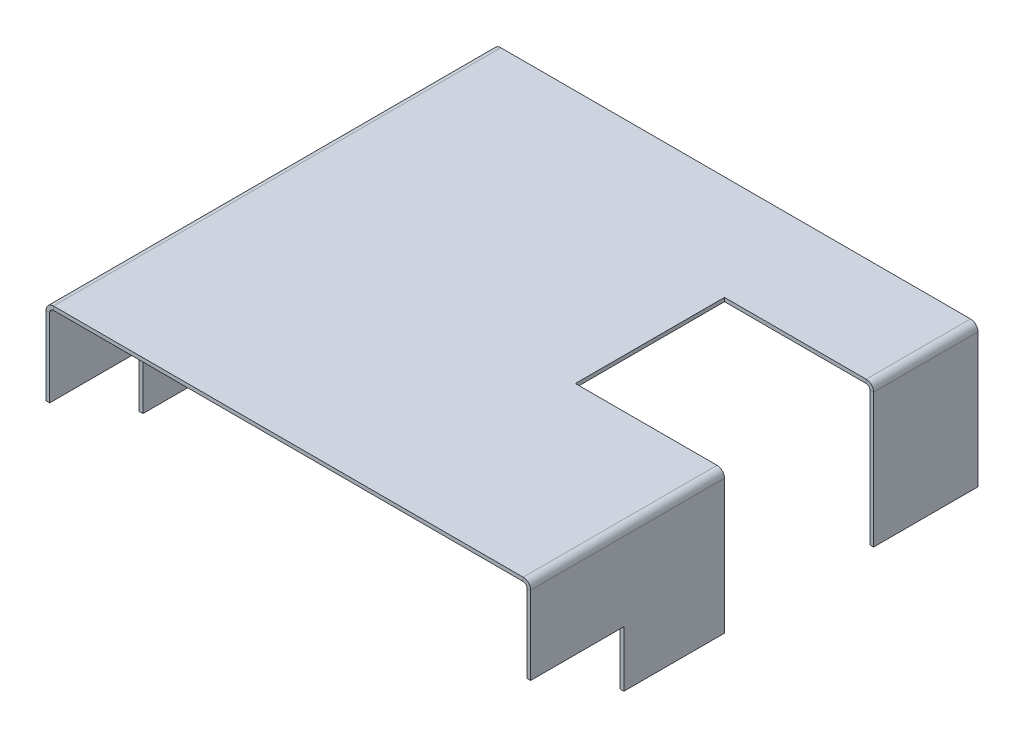
ISO-10303-21;
HEADER;
FILE_DESCRIPTION(('STEP AP214'),'2;1');
FILE_NAME('part.step','',(''),(''),'','','');
FILE_SCHEMA(('AUTOMOTIVE_DESIGN { 1 0 10303 214 1 1 1 1 }'));
ENDSEC;
DATA;
#1=APPLICATION_CONTEXT('core data for automotive mechanical design processes');
#2=APPLICATION_PROTOCOL_DEFINITION('international standard','automotive_design',2000,#1);
#3=PRODUCT_CONTEXT('',#1,'mechanical');
#4=PRODUCT('Part','Part','',(#3));
#5=PRODUCT_RELATED_PRODUCT_CATEGORY('part','',(#4));
#6=PRODUCT_DEFINITION_FORMATION('','',#4);
#7=PRODUCT_DEFINITION_CONTEXT('part definition',#1,'design');
#8=PRODUCT_DEFINITION('design','',#6,#7);
#9=PRODUCT_DEFINITION_SHAPE('','',#8);
#10=(LENGTH_UNIT() NAMED_UNIT(*) SI_UNIT(.MILLI.,.METRE.));
#11=(NAMED_UNIT(*) PLANE_ANGLE_UNIT() SI_UNIT($,.RADIAN.));
#12=(NAMED_UNIT(*) SI_UNIT($,.STERADIAN.) SOLID_ANGLE_UNIT());
#13=UNCERTAINTY_MEASURE_WITH_UNIT(LENGTH_MEASURE(1.E-05),#10,'distance_accuracy_value','');
#14=(GEOMETRIC_REPRESENTATION_CONTEXT(3) GLOBAL_UNCERTAINTY_ASSIGNED_CONTEXT((#13)) GLOBAL_UNIT_ASSIGNED_CONTEXT((#10,
#11,#12)) REPRESENTATION_CONTEXT('',''));
#15=CARTESIAN_POINT('',(0.,0.,0.));
#16=DIRECTION('',(0.,0.,1.));
#17=DIRECTION('',(1.,0.,0.));
#18=AXIS2_PLACEMENT_3D('',#15,#16,#17);
#19=CARTESIAN_POINT('',(31.75,0.,-66.04));
#20=DIRECTION('',(0.,0.,1.));
#21=DIRECTION('',(1.,0.,0.));
#22=AXIS2_PLACEMENT_3D('',#19,#20,#21);
#23=PLANE('',#22);
#24=DIRECTION('',(1.,0.,0.));
#25=VECTOR('',#24,1.);
#26=CARTESIAN_POINT('',(31.75,48.26,-66.04));
#27=LINE('',#26,#25);
#28=CARTESIAN_POINT('',(31.75,48.26,-66.04));
#29=VERTEX_POINT('',#28);
#30=CARTESIAN_POINT('',(80.0099999999999,48.26,-66.04));
#31=VERTEX_POINT('',#30);
#32=EDGE_CURVE('E202',#29,#31,#27,.T.);
#33=ORIENTED_EDGE('',*,*,#32,.T.);
#34=DIRECTION('',(0.,-1.,0.));
#35=VECTOR('',#34,1.);
#36=CARTESIAN_POINT('',(80.0099999999999,48.26,-66.04));
#37=LINE('',#36,#35);
#38=CARTESIAN_POINT('',(80.01,46.99,-66.04));
#39=VERTEX_POINT('',#38);
#40=EDGE_CURVE('E11',#31,#39,#37,.T.);
#41=ORIENTED_EDGE('',*,*,#40,.T.);
#42=DIRECTION('',(-1.,0.,0.));
#43=VECTOR('',#42,1.);
#44=CARTESIAN_POINT('',(-81.28,46.99,-66.04));
#45=LINE('',#44,#43);
#46=CARTESIAN_POINT('',(31.75,46.99,-66.04));
#47=VERTEX_POINT('',#46);
#48=EDGE_CURVE('E205',#39,#47,#45,.T.);
#49=ORIENTED_EDGE('',*,*,#48,.T.);
#50=DIRECTION('',(0.,1.,0.));
#51=VECTOR('',#50,1.);
#52=CARTESIAN_POINT('',(31.75,0.,-66.04));
#53=LINE('',#52,#51);
#54=EDGE_CURVE('E199',#47,#29,#53,.T.);
#55=ORIENTED_EDGE('',*,*,#54,.T.);
#56=EDGE_LOOP('',(#33,#41,#49,#55));
#57=FACE_BOUND('',#56,.T.);
#58=ADVANCED_FACE('F38',(#57),#23,.F.);
#59=DIRECTION('',(0.,1.,0.));
#60=VECTOR('',#59,1.);
#61=CARTESIAN_POINT('',(81.28,46.99,-66.04));
#62=LINE('',#61,#60);
#63=CARTESIAN_POINT('',(81.28,0.,-66.04));
#64=VERTEX_POINT('',#63);
#65=CARTESIAN_POINT('',(81.28,45.72,-66.04));
#66=VERTEX_POINT('',#65);
#67=EDGE_CURVE('E237',#64,#66,#62,.T.);
#68=ORIENTED_EDGE('',*,*,#67,.T.);
#69=DIRECTION('',(1.,0.,0.));
#70=VECTOR('',#69,1.);
#71=CARTESIAN_POINT('',(81.28,45.72,-66.04));
#72=LINE('',#71,#70);
#73=CARTESIAN_POINT('',(82.55,45.72,-66.04));
#74=VERTEX_POINT('',#73);
#75=EDGE_CURVE('E46',#66,#74,#72,.T.);
#76=ORIENTED_EDGE('',*,*,#75,.T.);
#77=DIRECTION('',(0.,1.,0.));
#78=VECTOR('',#77,1.);
#79=CARTESIAN_POINT('',(82.55,46.99,-66.04));
#80=LINE('',#79,#78);
#81=CARTESIAN_POINT('',(82.55,0.,-66.04));
#82=VERTEX_POINT('',#81);
#83=EDGE_CURVE('E229',#82,#74,#80,.T.);
#84=ORIENTED_EDGE('',*,*,#83,.F.);
#85=DIRECTION('',(1.,0.,0.));
#86=VECTOR('',#85,1.);
#87=CARTESIAN_POINT('',(31.75,0.,-66.04));
#88=LINE('',#87,#86);
#89=EDGE_CURVE('E225',#64,#82,#88,.T.);
#90=ORIENTED_EDGE('',*,*,#89,.F.);
#91=EDGE_LOOP('',(#68,#76,#84,#90));
#92=FACE_BOUND('',#91,.T.);
#93=ADVANCED_FACE('F412',(#92),#23,.F.);
#94=CARTESIAN_POINT('',(31.75,0.,-116.84));
#95=DIRECTION('',(0.,0.,-1.));
#96=DIRECTION('',(-1.,0.,0.));
#97=AXIS2_PLACEMENT_3D('',#94,#95,#96);
#98=PLANE('',#97);
#99=DIRECTION('',(1.,0.,0.));
#100=VECTOR('',#99,1.);
#101=CARTESIAN_POINT('',(-81.28,46.99,-116.84));
#102=LINE('',#101,#100);
#103=CARTESIAN_POINT('',(31.75,46.99,-116.84));
#104=VERTEX_POINT('',#103);
#105=CARTESIAN_POINT('',(80.01,46.99,-116.84));
#106=VERTEX_POINT('',#105);
#107=EDGE_CURVE('E246',#104,#106,#102,.T.);
#108=ORIENTED_EDGE('',*,*,#107,.T.);
#109=DIRECTION('',(0.,1.,0.));
#110=VECTOR('',#109,1.);
#111=CARTESIAN_POINT('',(80.01,46.99,-116.84));
#112=LINE('',#111,#110);
#113=CARTESIAN_POINT('',(80.01,48.26,-116.84));
#114=VERTEX_POINT('',#113);
#115=EDGE_CURVE('E410',#106,#114,#112,.T.);
#116=ORIENTED_EDGE('',*,*,#115,.T.);
#117=DIRECTION('',(-1.,0.,0.));
#118=VECTOR('',#117,1.);
#119=CARTESIAN_POINT('',(31.75,48.26,-116.84));
#120=LINE('',#119,#118);
#121=CARTESIAN_POINT('',(31.75,48.26,-116.84));
#122=VERTEX_POINT('',#121);
#123=EDGE_CURVE('E223',#114,#122,#120,.T.);
#124=ORIENTED_EDGE('',*,*,#123,.T.);
#125=DIRECTION('',(0.,1.,0.));
#126=VECTOR('',#125,1.);
#127=CARTESIAN_POINT('',(31.75,0.,-116.84));
#128=LINE('',#127,#126);
#129=EDGE_CURVE('E208',#104,#122,#128,.T.);
#130=ORIENTED_EDGE('',*,*,#129,.F.);
#131=EDGE_LOOP('',(#108,#116,#124,#130));
#132=FACE_BOUND('',#131,.T.);
#133=ADVANCED_FACE('F472',(#132),#98,.F.);
#134=DIRECTION('',(0.,-1.,0.));
#135=VECTOR('',#134,1.);
#136=CARTESIAN_POINT('',(82.55,46.99,-116.84));
#137=LINE('',#136,#135);
#138=CARTESIAN_POINT('',(82.55,45.72,-116.84));
#139=VERTEX_POINT('',#138);
#140=CARTESIAN_POINT('',(82.55,0.,-116.84));
#141=VERTEX_POINT('',#140);
#142=EDGE_CURVE('E240',#139,#141,#137,.T.);
#143=ORIENTED_EDGE('',*,*,#142,.F.);
#144=DIRECTION('',(-1.,0.,0.));
#145=VECTOR('',#144,1.);
#146=CARTESIAN_POINT('',(82.55,45.72,-116.84));
#147=LINE('',#146,#145);
#148=CARTESIAN_POINT('',(81.28,45.72,-116.84));
#149=VERTEX_POINT('',#148);
#150=EDGE_CURVE('E408',#139,#149,#147,.T.);
#151=ORIENTED_EDGE('',*,*,#150,.T.);
#152=DIRECTION('',(0.,-1.,0.));
#153=VECTOR('',#152,1.);
#154=CARTESIAN_POINT('',(81.28,46.99,-116.84));
#155=LINE('',#154,#153);
#156=CARTESIAN_POINT('',(81.28,0.,-116.84));
#157=VERTEX_POINT('',#156);
#158=EDGE_CURVE('E249',#149,#157,#155,.T.);
#159=ORIENTED_EDGE('',*,*,#158,.T.);
#160=DIRECTION('',(-1.,0.,0.));
#161=VECTOR('',#160,1.);
#162=CARTESIAN_POINT('',(31.75,0.,-116.84));
#163=LINE('',#162,#161);
#164=EDGE_CURVE('E209',#141,#157,#163,.T.);
#165=ORIENTED_EDGE('',*,*,#164,.F.);
#166=EDGE_LOOP('',(#143,#151,#159,#165));
#167=FACE_BOUND('',#166,.T.);
#168=ADVANCED_FACE('F462',(#167),#98,.F.);
#169=CARTESIAN_POINT('',(81.28,0.,-152.4));
#170=DIRECTION('',(0.,-1.,0.));
#171=DIRECTION('',(0.,0.,1.));
#172=AXIS2_PLACEMENT_3D('',#169,#170,#171);
#173=PLANE('',#172);
#174=ORIENTED_EDGE('',*,*,#164,.T.);
#175=DIRECTION('',(0.,0.,1.));
#176=VECTOR('',#175,1.);
#177=CARTESIAN_POINT('',(81.28,0.,-152.4));
#178=LINE('',#177,#176);
#179=CARTESIAN_POINT('',(81.28,0.,-152.4));
#180=VERTEX_POINT('',#179);
#181=EDGE_CURVE('E302',#180,#157,#178,.T.);
#182=ORIENTED_EDGE('',*,*,#181,.F.);
#183=DIRECTION('',(-1.,0.,0.));
#184=VECTOR('',#183,1.);
#185=CARTESIAN_POINT('',(81.28,0.,-152.4));
#186=LINE('',#185,#184);
#187=CARTESIAN_POINT('',(82.55,0.,-152.4));
#188=VERTEX_POINT('',#187);
#189=EDGE_CURVE('E378',#188,#180,#186,.T.);
#190=ORIENTED_EDGE('',*,*,#189,.F.);
#191=DIRECTION('',(0.,0.,1.));
#192=VECTOR('',#191,1.);
#193=CARTESIAN_POINT('',(82.55,0.,-152.4));
#194=LINE('',#193,#192);
#195=EDGE_CURVE('E349',#188,#141,#194,.T.);
#196=ORIENTED_EDGE('',*,*,#195,.T.);
#197=EDGE_LOOP('',(#174,#182,#190,#196));
#198=FACE_BOUND('',#197,.T.);
#199=ADVANCED_FACE('F445',(#198),#173,.T.);
#200=CARTESIAN_POINT('',(81.28,46.99,-152.4));
#201=DIRECTION('',(-1.,0.,0.));
#202=DIRECTION('',(0.,-1.,0.));
#203=AXIS2_PLACEMENT_3D('',#200,#201,#202);
#204=PLANE('',#203);
#205=ORIENTED_EDGE('',*,*,#158,.F.);
#206=DIRECTION('',(0.,0.,1.));
#207=VECTOR('',#206,1.);
#208=CARTESIAN_POINT('',(81.28,45.72,-152.4));
#209=LINE('',#208,#207);
#210=CARTESIAN_POINT('',(81.28,45.72,-152.4));
#211=VERTEX_POINT('',#210);
#212=EDGE_CURVE('E309',#149,#211,#209,.F.);
#213=ORIENTED_EDGE('',*,*,#212,.T.);
#214=DIRECTION('',(0.,-1.,0.));
#215=VECTOR('',#214,1.);
#216=CARTESIAN_POINT('',(81.28,46.99,-152.4));
#217=LINE('',#216,#215);
#218=EDGE_CURVE('E298',#211,#180,#217,.T.);
#219=ORIENTED_EDGE('',*,*,#218,.T.);
#220=ORIENTED_EDGE('',*,*,#181,.T.);
#221=EDGE_LOOP('',(#205,#213,#219,#220));
#222=FACE_BOUND('',#221,.T.);
#223=ADVANCED_FACE('F451',(#222),#204,.T.);
#224=CARTESIAN_POINT('',(80.01,45.72,-152.4));
#225=DIRECTION('',(0.,0.,-1.));
#226=DIRECTION('',(-1.,0.,0.));
#227=AXIS2_PLACEMENT_3D('',#224,#225,#226);
#228=CYLINDRICAL_SURFACE('',#227,1.27);
#229=ORIENTED_EDGE('',*,*,#212,.F.);
#230=CARTESIAN_POINT('',(80.01,45.72,-116.84));
#231=DIRECTION('',(0.,0.,-1.));
#232=DIRECTION('',(-1.,0.,0.));
#233=AXIS2_PLACEMENT_3D('',#230,#231,#232);
#234=CIRCLE('',#233,1.27);
#235=EDGE_CURVE('E243',#149,#106,#234,.F.);
#236=ORIENTED_EDGE('',*,*,#235,.T.);
#237=DIRECTION('',(0.,0.,1.));
#238=VECTOR('',#237,1.);
#239=CARTESIAN_POINT('',(80.01,46.99,0.));
#240=LINE('',#239,#238);
#241=CARTESIAN_POINT('',(80.01,46.99,-152.4));
#242=VERTEX_POINT('',#241);
#243=EDGE_CURVE('E306',#242,#106,#240,.T.);
#244=ORIENTED_EDGE('',*,*,#243,.F.);
#245=CARTESIAN_POINT('',(80.01,45.72,-152.4));
#246=DIRECTION('',(0.,0.,1.));
#247=DIRECTION('',(1.,0.,0.));
#248=AXIS2_PLACEMENT_3D('',#245,#246,#247);
#249=CIRCLE('',#248,1.27);
#250=EDGE_CURVE('E283',#242,#211,#249,.F.);
#251=ORIENTED_EDGE('',*,*,#250,.T.);
#252=EDGE_LOOP('',(#229,#236,#244,#251));
#253=FACE_BOUND('',#252,.T.);
#254=ADVANCED_FACE('F477',(#253),#228,.F.);
#255=CARTESIAN_POINT('',(82.55,46.99,-152.4));
#256=DIRECTION('',(-1.,0.,0.));
#257=DIRECTION('',(0.,-1.,0.));
#258=AXIS2_PLACEMENT_3D('',#255,#256,#257);
#259=PLANE('',#258);
#260=DIRECTION('',(0.,0.,1.));
#261=VECTOR('',#260,1.);
#262=CARTESIAN_POINT('',(82.55,45.72,-152.4));
#263=LINE('',#262,#261);
#264=CARTESIAN_POINT('',(82.55,45.72,-152.4));
#265=VERTEX_POINT('',#264);
#266=EDGE_CURVE('E336',#139,#265,#263,.F.);
#267=ORIENTED_EDGE('',*,*,#266,.F.);
#268=ORIENTED_EDGE('',*,*,#142,.T.);
#269=ORIENTED_EDGE('',*,*,#195,.F.);
#270=DIRECTION('',(0.,-1.,0.));
#271=VECTOR('',#270,1.);
#272=CARTESIAN_POINT('',(82.55,46.99,-152.4));
#273=LINE('',#272,#271);
#274=EDGE_CURVE('E347',#265,#188,#273,.T.);
#275=ORIENTED_EDGE('',*,*,#274,.F.);
#276=EDGE_LOOP('',(#267,#268,#269,#275));
#277=FACE_BOUND('',#276,.T.);
#278=ADVANCED_FACE('F460',(#277),#259,.F.);
#279=CARTESIAN_POINT('',(80.01,45.72,-152.4));
#280=DIRECTION('',(0.,0.,-1.));
#281=DIRECTION('',(-1.,0.,0.));
#282=AXIS2_PLACEMENT_3D('',#279,#280,#281);
#283=CYLINDRICAL_SURFACE('',#282,2.54);
#284=CARTESIAN_POINT('',(80.01,45.72,-116.84));
#285=DIRECTION('',(0.,0.,-1.));
#286=DIRECTION('',(-1.,0.,0.));
#287=AXIS2_PLACEMENT_3D('',#284,#285,#286);
#288=CIRCLE('',#287,2.54);
#289=EDGE_CURVE('E405',#139,#114,#288,.F.);
#290=ORIENTED_EDGE('',*,*,#289,.F.);
#291=ORIENTED_EDGE('',*,*,#266,.T.);
#292=CARTESIAN_POINT('',(80.01,45.72,-152.4));
#293=DIRECTION('',(0.,0.,-1.));
#294=DIRECTION('',(-1.,0.,0.));
#295=AXIS2_PLACEMENT_3D('',#292,#293,#294);
#296=CIRCLE('',#295,2.54);
#297=CARTESIAN_POINT('',(80.0099999999999,48.26,-152.4));
#298=VERTEX_POINT('',#297);
#299=EDGE_CURVE('E355',#298,#265,#296,.T.);
#300=ORIENTED_EDGE('',*,*,#299,.F.);
#301=DIRECTION('',(0.,0.,-1.));
#302=VECTOR('',#301,1.);
#303=CARTESIAN_POINT('',(80.0099999999999,48.26,-152.4));
#304=LINE('',#303,#302);
#305=EDGE_CURVE('E337',#298,#114,#304,.F.);
#306=ORIENTED_EDGE('',*,*,#305,.T.);
#307=EDGE_LOOP('',(#290,#291,#300,#306));
#308=FACE_BOUND('',#307,.T.);
#309=ADVANCED_FACE('F465',(#308),#283,.T.);
#310=CARTESIAN_POINT('',(-81.28,46.99,0.));
#311=DIRECTION('',(0.,0.,-1.));
#312=DIRECTION('',(1.,0.,0.));
#313=AXIS2_PLACEMENT_3D('',#310,#311,#312);
#314=PLANE('',#313);
#315=DIRECTION('',(0.,-1.,0.));
#316=VECTOR('',#315,1.);
#317=CARTESIAN_POINT('',(80.01,46.99,0.));
#318=LINE('',#317,#316);
#319=CARTESIAN_POINT('',(80.01,48.26,0.));
#320=VERTEX_POINT('',#319);
#321=CARTESIAN_POINT('',(80.01,46.99,0.));
#322=VERTEX_POINT('',#321);
#323=EDGE_CURVE('E396',#320,#322,#318,.T.);
#324=ORIENTED_EDGE('',*,*,#323,.F.);
#325=DIRECTION('',(1.,0.,0.));
#326=VECTOR('',#325,1.);
#327=CARTESIAN_POINT('',(-81.28,48.26,0.));
#328=LINE('',#327,#326);
#329=CARTESIAN_POINT('',(-80.01,48.26,0.));
#330=VERTEX_POINT('',#329);
#331=EDGE_CURVE('E362',#330,#320,#328,.T.);
#332=ORIENTED_EDGE('',*,*,#331,.F.);
#333=DIRECTION('',(0.,-1.,0.));
#334=VECTOR('',#333,1.);
#335=CARTESIAN_POINT('',(-80.01,46.99,0.));
#336=LINE('',#335,#334);
#337=CARTESIAN_POINT('',(-80.01,46.99,0.));
#338=VERTEX_POINT('',#337);
#339=EDGE_CURVE('E394',#330,#338,#336,.T.);
#340=ORIENTED_EDGE('',*,*,#339,.T.);
#341=DIRECTION('',(1.,0.,0.));
#342=VECTOR('',#341,1.);
#343=CARTESIAN_POINT('',(-81.28,46.99,0.));
#344=LINE('',#343,#342);
#345=EDGE_CURVE('E289',#338,#322,#344,.T.);
#346=ORIENTED_EDGE('',*,*,#345,.T.);
#347=EDGE_LOOP('',(#324,#332,#340,#346));
#348=FACE_BOUND('',#347,.T.);
#349=ADVANCED_FACE('F594',(#348),#314,.F.);
#350=CARTESIAN_POINT('',(-80.01,45.72,0.));
#351=DIRECTION('',(0.,0.,1.));
#352=DIRECTION('',(1.,0.,0.));
#353=AXIS2_PLACEMENT_3D('',#350,#351,#352);
#354=PLANE('',#353);
#355=ORIENTED_EDGE('',*,*,#339,.F.);
#356=CARTESIAN_POINT('',(-80.01,45.72,0.));
#357=DIRECTION('',(0.,0.,-1.));
#358=DIRECTION('',(-1.,0.,0.));
#359=AXIS2_PLACEMENT_3D('',#356,#357,#358);
#360=CIRCLE('',#359,2.54);
#361=CARTESIAN_POINT('',(-82.55,45.72,0.));
#362=VERTEX_POINT('',#361);
#363=EDGE_CURVE('E279',#330,#362,#360,.F.);
#364=ORIENTED_EDGE('',*,*,#363,.T.);
#365=DIRECTION('',(1.,0.,0.));
#366=VECTOR('',#365,1.);
#367=CARTESIAN_POINT('',(-81.28,45.72,0.));
#368=LINE('',#367,#366);
#369=CARTESIAN_POINT('',(-81.28,45.72,0.));
#370=VERTEX_POINT('',#369);
#371=EDGE_CURVE('E391',#362,#370,#368,.T.);
#372=ORIENTED_EDGE('',*,*,#371,.T.);
#373=CARTESIAN_POINT('',(-80.01,45.72,0.));
#374=DIRECTION('',(0.,0.,-1.));
#375=DIRECTION('',(-1.,0.,0.));
#376=AXIS2_PLACEMENT_3D('',#373,#374,#375);
#377=CIRCLE('',#376,1.27);
#378=EDGE_CURVE('E326',#338,#370,#377,.F.);
#379=ORIENTED_EDGE('',*,*,#378,.F.);
#380=EDGE_LOOP('',(#355,#364,#372,#379));
#381=FACE_BOUND('',#380,.T.);
#382=ADVANCED_FACE('F526',(#381),#354,.T.);
#383=CARTESIAN_POINT('',(-81.28,0.,0.));
#384=DIRECTION('',(0.,0.,-1.));
#385=DIRECTION('',(0.,1.,0.));
#386=AXIS2_PLACEMENT_3D('',#383,#384,#385);
#387=PLANE('',#386);
#388=DIRECTION('',(1.,0.,0.));
#389=VECTOR('',#388,1.);
#390=CARTESIAN_POINT('',(-81.28,19.05,0.));
#391=LINE('',#390,#389);
#392=CARTESIAN_POINT('',(-81.28,19.05,0.));
#393=VERTEX_POINT('',#392);
#394=CARTESIAN_POINT('',(-82.55,19.05,0.));
#395=VERTEX_POINT('',#394);
#396=EDGE_CURVE('E264',#393,#395,#391,.F.);
#397=ORIENTED_EDGE('',*,*,#396,.F.);
#398=DIRECTION('',(0.,1.,0.));
#399=VECTOR('',#398,1.);
#400=CARTESIAN_POINT('',(-81.28,0.,0.));
#401=LINE('',#400,#399);
#402=EDGE_CURVE('E280',#393,#370,#401,.T.);
#403=ORIENTED_EDGE('',*,*,#402,.T.);
#404=ORIENTED_EDGE('',*,*,#371,.F.);
#405=DIRECTION('',(0.,1.,0.));
#406=VECTOR('',#405,1.);
#407=CARTESIAN_POINT('',(-82.55,0.,0.));
#408=LINE('',#407,#406);
#409=EDGE_CURVE('E358',#395,#362,#408,.T.);
#410=ORIENTED_EDGE('',*,*,#409,.F.);
#411=EDGE_LOOP('',(#397,#403,#404,#410));
#412=FACE_BOUND('',#411,.T.);
#413=ADVANCED_FACE('F522',(#412),#387,.F.);
#414=CARTESIAN_POINT('',(-81.28,0.,-152.4));
#415=DIRECTION('',(0.,1.,0.));
#416=DIRECTION('',(0.,0.,1.));
#417=AXIS2_PLACEMENT_3D('',#414,#415,#416);
#418=PLANE('',#417);
#419=DIRECTION('',(-1.,0.,0.));
#420=VECTOR('',#419,1.);
#421=CARTESIAN_POINT('',(-81.28,0.,-31.75));
#422=LINE('',#421,#420);
#423=CARTESIAN_POINT('',(-82.55,0.,-31.75));
#424=VERTEX_POINT('',#423);
#425=CARTESIAN_POINT('',(-81.28,0.,-31.75));
#426=VERTEX_POINT('',#425);
#427=EDGE_CURVE('E272',#424,#426,#422,.F.);
#428=ORIENTED_EDGE('',*,*,#427,.F.);
#429=DIRECTION('',(0.,0.,-1.));
#430=VECTOR('',#429,1.);
#431=CARTESIAN_POINT('',(-82.55,0.,-152.4));
#432=LINE('',#431,#430);
#433=CARTESIAN_POINT('',(-82.55,0.,-152.4));
#434=VERTEX_POINT('',#433);
#435=EDGE_CURVE('E369',#434,#424,#432,.F.);
#436=ORIENTED_EDGE('',*,*,#435,.F.);
#437=DIRECTION('',(1.,0.,0.));
#438=VECTOR('',#437,1.);
#439=CARTESIAN_POINT('',(-81.28,0.,-152.4));
#440=LINE('',#439,#438);
#441=CARTESIAN_POINT('',(-81.28,0.,-152.4));
#442=VERTEX_POINT('',#441);
#443=EDGE_CURVE('E389',#434,#442,#440,.T.);
#444=ORIENTED_EDGE('',*,*,#443,.T.);
#445=DIRECTION('',(0.,0.,1.));
#446=VECTOR('',#445,1.);
#447=CARTESIAN_POINT('',(-81.28,0.,-152.4));
#448=LINE('',#447,#446);
#449=EDGE_CURVE('E282',#442,#426,#448,.T.);
#450=ORIENTED_EDGE('',*,*,#449,.T.);
#451=EDGE_LOOP('',(#428,#436,#444,#450));
#452=FACE_BOUND('',#451,.T.);
#453=ADVANCED_FACE('F506',(#452),#418,.F.);
#454=CARTESIAN_POINT('',(-81.28,0.,-152.4));
#455=DIRECTION('',(0.,0.,-1.));
#456=DIRECTION('',(0.,1.,0.));
#457=AXIS2_PLACEMENT_3D('',#454,#455,#456);
#458=PLANE('',#457);
#459=ORIENTED_EDGE('',*,*,#443,.F.);
#460=DIRECTION('',(0.,1.,0.));
#461=VECTOR('',#460,1.);
#462=CARTESIAN_POINT('',(-82.55,0.,-152.4));
#463=LINE('',#462,#461);
#464=CARTESIAN_POINT('',(-82.55,45.72,-152.4));
#465=VERTEX_POINT('',#464);
#466=EDGE_CURVE('E366',#434,#465,#463,.T.);
#467=ORIENTED_EDGE('',*,*,#466,.T.);
#468=DIRECTION('',(1.,0.,0.));
#469=VECTOR('',#468,1.);
#470=CARTESIAN_POINT('',(-81.28,45.72,-152.4));
#471=LINE('',#470,#469);
#472=CARTESIAN_POINT('',(-81.28,45.72,-152.4));
#473=VERTEX_POINT('',#472);
#474=EDGE_CURVE('E387',#465,#473,#471,.T.);
#475=ORIENTED_EDGE('',*,*,#474,.T.);
#476=DIRECTION('',(0.,1.,0.));
#477=VECTOR('',#476,1.);
#478=CARTESIAN_POINT('',(-81.28,0.,-152.4));
#479=LINE('',#478,#477);
#480=EDGE_CURVE('E286',#442,#473,#479,.T.);
#481=ORIENTED_EDGE('',*,*,#480,.F.);
#482=EDGE_LOOP('',(#459,#467,#475,#481));
#483=FACE_BOUND('',#482,.T.);
#484=ADVANCED_FACE('F498',(#483),#458,.T.);
#485=CARTESIAN_POINT('',(-80.01,45.72,-152.4));
#486=DIRECTION('',(0.,0.,-1.));
#487=DIRECTION('',(-1.,0.,0.));
#488=AXIS2_PLACEMENT_3D('',#485,#486,#487);
#489=PLANE('',#488);
#490=ORIENTED_EDGE('',*,*,#474,.F.);
#491=CARTESIAN_POINT('',(-80.01,45.72,-152.4));
#492=DIRECTION('',(0.,0.,-1.));
#493=DIRECTION('',(-1.,0.,0.));
#494=AXIS2_PLACEMENT_3D('',#491,#492,#493);
#495=CIRCLE('',#494,2.54);
#496=CARTESIAN_POINT('',(-80.01,48.26,-152.4));
#497=VERTEX_POINT('',#496);
#498=EDGE_CURVE('E363',#465,#497,#495,.T.);
#499=ORIENTED_EDGE('',*,*,#498,.T.);
#500=DIRECTION('',(0.,-1.,0.));
#501=VECTOR('',#500,1.);
#502=CARTESIAN_POINT('',(-80.01,46.99,-152.4));
#503=LINE('',#502,#501);
#504=CARTESIAN_POINT('',(-80.01,46.99,-152.4));
#505=VERTEX_POINT('',#504);
#506=EDGE_CURVE('E385',#497,#505,#503,.T.);
#507=ORIENTED_EDGE('',*,*,#506,.T.);
#508=CARTESIAN_POINT('',(-80.01,45.72,-152.4));
#509=DIRECTION('',(0.,0.,1.));
#510=DIRECTION('',(1.,0.,0.));
#511=AXIS2_PLACEMENT_3D('',#508,#509,#510);
#512=CIRCLE('',#511,1.27);
#513=EDGE_CURVE('E317',#473,#505,#512,.F.);
#514=ORIENTED_EDGE('',*,*,#513,.F.);
#515=EDGE_LOOP('',(#490,#499,#507,#514));
#516=FACE_BOUND('',#515,.T.);
#517=ADVANCED_FACE('F491',(#516),#489,.T.);
#518=CARTESIAN_POINT('',(-81.28,46.99,-152.4));
#519=DIRECTION('',(0.,0.,-1.));
#520=DIRECTION('',(1.,0.,0.));
#521=AXIS2_PLACEMENT_3D('',#518,#519,#520);
#522=PLANE('',#521);
#523=ORIENTED_EDGE('',*,*,#506,.F.);
#524=DIRECTION('',(1.,0.,0.));
#525=VECTOR('',#524,1.);
#526=CARTESIAN_POINT('',(-81.28,48.26,-152.4));
#527=LINE('',#526,#525);
#528=EDGE_CURVE('E348',#497,#298,#527,.T.);
#529=ORIENTED_EDGE('',*,*,#528,.T.);
#530=DIRECTION('',(0.,-1.,0.));
#531=VECTOR('',#530,1.);
#532=CARTESIAN_POINT('',(80.01,46.99,-152.4));
#533=LINE('',#532,#531);
#534=EDGE_CURVE('E383',#298,#242,#533,.T.);
#535=ORIENTED_EDGE('',*,*,#534,.T.);
#536=DIRECTION('',(1.,0.,0.));
#537=VECTOR('',#536,1.);
#538=CARTESIAN_POINT('',(-81.28,46.99,-152.4));
#539=LINE('',#538,#537);
#540=EDGE_CURVE('E292',#505,#242,#539,.T.);
#541=ORIENTED_EDGE('',*,*,#540,.F.);
#542=EDGE_LOOP('',(#523,#529,#535,#541));
#543=FACE_BOUND('',#542,.T.);
#544=ADVANCED_FACE('F486',(#543),#522,.T.);
#545=CARTESIAN_POINT('',(80.01,45.72,-152.4));
#546=DIRECTION('',(0.,0.,-1.));
#547=DIRECTION('',(-1.,0.,0.));
#548=AXIS2_PLACEMENT_3D('',#545,#546,#547);
#549=PLANE('',#548);
#550=ORIENTED_EDGE('',*,*,#534,.F.);
#551=ORIENTED_EDGE('',*,*,#299,.T.);
#552=DIRECTION('',(-1.,0.,0.));
#553=VECTOR('',#552,1.);
#554=CARTESIAN_POINT('',(81.28,45.72,-152.4));
#555=LINE('',#554,#553);
#556=EDGE_CURVE('E380',#265,#211,#555,.T.);
#557=ORIENTED_EDGE('',*,*,#556,.T.);
#558=ORIENTED_EDGE('',*,*,#250,.F.);
#559=EDGE_LOOP('',(#550,#551,#557,#558));
#560=FACE_BOUND('',#559,.T.);
#561=ADVANCED_FACE('F485',(#560),#549,.T.);
#562=CARTESIAN_POINT('',(81.28,46.99,-152.4));
#563=DIRECTION('',(0.,0.,-1.));
#564=DIRECTION('',(0.,-1.,0.));
#565=AXIS2_PLACEMENT_3D('',#562,#563,#564);
#566=PLANE('',#565);
#567=ORIENTED_EDGE('',*,*,#556,.F.);
#568=ORIENTED_EDGE('',*,*,#274,.T.);
#569=ORIENTED_EDGE('',*,*,#189,.T.);
#570=ORIENTED_EDGE('',*,*,#218,.F.);
#571=EDGE_LOOP('',(#567,#568,#569,#570));
#572=FACE_BOUND('',#571,.T.);
#573=ADVANCED_FACE('F456',(#572),#566,.T.);
#574=ORIENTED_EDGE('',*,*,#89,.T.);
#575=CARTESIAN_POINT('',(82.55,0.,-31.75));
#576=VERTEX_POINT('',#575);
#577=EDGE_CURVE('E352',#82,#576,#194,.T.);
#578=ORIENTED_EDGE('',*,*,#577,.T.);
#579=DIRECTION('',(1.,0.,0.));
#580=VECTOR('',#579,1.);
#581=CARTESIAN_POINT('',(81.28,0.,-31.75));
#582=LINE('',#581,#580);
#583=CARTESIAN_POINT('',(81.28,0.,-31.75));
#584=VERTEX_POINT('',#583);
#585=EDGE_CURVE('E277',#584,#576,#582,.T.);
#586=ORIENTED_EDGE('',*,*,#585,.F.);
#587=EDGE_CURVE('E301',#64,#584,#178,.T.);
#588=ORIENTED_EDGE('',*,*,#587,.F.);
#589=EDGE_LOOP('',(#574,#578,#586,#588));
#590=FACE_BOUND('',#589,.T.);
#591=ADVANCED_FACE('F440',(#590),#173,.T.);
#592=CARTESIAN_POINT('',(81.28,46.99,0.));
#593=DIRECTION('',(0.,0.,-1.));
#594=DIRECTION('',(0.,-1.,0.));
#595=AXIS2_PLACEMENT_3D('',#592,#593,#594);
#596=PLANE('',#595);
#597=DIRECTION('',(1.,0.,0.));
#598=VECTOR('',#597,1.);
#599=CARTESIAN_POINT('',(81.28,19.05,0.));
#600=LINE('',#599,#598);
#601=CARTESIAN_POINT('',(82.55,19.05,0.));
#602=VERTEX_POINT('',#601);
#603=CARTESIAN_POINT('',(81.28,19.05,0.));
#604=VERTEX_POINT('',#603);
#605=EDGE_CURVE('E268',#602,#604,#600,.F.);
#606=ORIENTED_EDGE('',*,*,#605,.F.);
#607=DIRECTION('',(0.,-1.,0.));
#608=VECTOR('',#607,1.);
#609=CARTESIAN_POINT('',(82.55,46.99,0.));
#610=LINE('',#609,#608);
#611=CARTESIAN_POINT('',(82.55,45.72,0.));
#612=VERTEX_POINT('',#611);
#613=EDGE_CURVE('E344',#612,#602,#610,.T.);
#614=ORIENTED_EDGE('',*,*,#613,.F.);
#615=DIRECTION('',(-1.,0.,0.));
#616=VECTOR('',#615,1.);
#617=CARTESIAN_POINT('',(81.28,45.72,0.));
#618=LINE('',#617,#616);
#619=CARTESIAN_POINT('',(81.28,45.72,0.));
#620=VERTEX_POINT('',#619);
#621=EDGE_CURVE('E325',#612,#620,#618,.T.);
#622=ORIENTED_EDGE('',*,*,#621,.T.);
#623=DIRECTION('',(0.,-1.,0.));
#624=VECTOR('',#623,1.);
#625=CARTESIAN_POINT('',(81.28,46.99,0.));
#626=LINE('',#625,#624);
#627=EDGE_CURVE('E295',#620,#604,#626,.T.);
#628=ORIENTED_EDGE('',*,*,#627,.T.);
#629=EDGE_LOOP('',(#606,#614,#622,#628));
#630=FACE_BOUND('',#629,.T.);
#631=ADVANCED_FACE('F428',(#630),#596,.F.);
#632=CARTESIAN_POINT('',(80.01,45.72,0.));
#633=DIRECTION('',(0.,0.,1.));
#634=DIRECTION('',(1.,0.,0.));
#635=AXIS2_PLACEMENT_3D('',#632,#633,#634);
#636=PLANE('',#635);
#637=CARTESIAN_POINT('',(80.01,45.72,0.));
#638=DIRECTION('',(0.,0.,-1.));
#639=DIRECTION('',(-1.,0.,0.));
#640=AXIS2_PLACEMENT_3D('',#637,#638,#639);
#641=CIRCLE('',#640,2.54);
#642=EDGE_CURVE('E359',#612,#320,#641,.F.);
#643=ORIENTED_EDGE('',*,*,#642,.T.);
#644=ORIENTED_EDGE('',*,*,#323,.T.);
#645=CARTESIAN_POINT('',(80.01,45.72,0.));
#646=DIRECTION('',(0.,0.,-1.));
#647=DIRECTION('',(-1.,0.,0.));
#648=AXIS2_PLACEMENT_3D('',#645,#646,#647);
#649=CIRCLE('',#648,1.27);
#650=EDGE_CURVE('E314',#620,#322,#649,.F.);
#651=ORIENTED_EDGE('',*,*,#650,.F.);
#652=ORIENTED_EDGE('',*,*,#621,.F.);
#653=EDGE_LOOP('',(#643,#644,#651,#652));
#654=FACE_BOUND('',#653,.T.);
#655=ADVANCED_FACE('F40',(#654),#636,.T.);
#656=ORIENTED_EDGE('',*,*,#67,.F.);
#657=ORIENTED_EDGE('',*,*,#587,.T.);
#658=DIRECTION('',(0.,-1.,0.));
#659=VECTOR('',#658,1.);
#660=CARTESIAN_POINT('',(81.28,46.99,-31.75));
#661=LINE('',#660,#659);
#662=CARTESIAN_POINT('',(81.28,19.05,-31.75));
#663=VERTEX_POINT('',#662);
#664=EDGE_CURVE('E274',#663,#584,#661,.T.);
#665=ORIENTED_EDGE('',*,*,#664,.F.);
#666=DIRECTION('',(0.,0.,-1.));
#667=VECTOR('',#666,1.);
#668=CARTESIAN_POINT('',(81.28,19.05,-152.4));
#669=LINE('',#668,#667);
#670=EDGE_CURVE('E266',#604,#663,#669,.T.);
#671=ORIENTED_EDGE('',*,*,#670,.F.);
#672=ORIENTED_EDGE('',*,*,#627,.F.);
#673=EDGE_CURVE('E310',#620,#66,#209,.F.);
#674=ORIENTED_EDGE('',*,*,#673,.T.);
#675=EDGE_LOOP('',(#656,#657,#665,#671,#672,#674));
#676=FACE_BOUND('',#675,.T.);
#677=ADVANCED_FACE('F437',(#676),#204,.T.);
#678=CARTESIAN_POINT('',(-81.28,46.99,-152.4));
#679=DIRECTION('',(0.,-1.,0.));
#680=DIRECTION('',(0.,0.,-1.));
#681=AXIS2_PLACEMENT_3D('',#678,#679,#680);
#682=PLANE('',#681);
#683=ORIENTED_EDGE('',*,*,#107,.F.);
#684=DIRECTION('',(0.,0.,-1.));
#685=VECTOR('',#684,1.);
#686=CARTESIAN_POINT('',(31.75,46.99,-152.4));
#687=LINE('',#686,#685);
#688=EDGE_CURVE('E251',#47,#104,#687,.T.);
#689=ORIENTED_EDGE('',*,*,#688,.F.);
#690=ORIENTED_EDGE('',*,*,#48,.F.);
#691=EDGE_CURVE('E305',#39,#322,#240,.T.);
#692=ORIENTED_EDGE('',*,*,#691,.T.);
#693=ORIENTED_EDGE('',*,*,#345,.F.);
#694=DIRECTION('',(0.,0.,1.));
#695=VECTOR('',#694,1.);
#696=CARTESIAN_POINT('',(-80.01,46.99,-152.4));
#697=LINE('',#696,#695);
#698=EDGE_CURVE('E322',#338,#505,#697,.F.);
#699=ORIENTED_EDGE('',*,*,#698,.T.);
#700=ORIENTED_EDGE('',*,*,#540,.T.);
#701=ORIENTED_EDGE('',*,*,#243,.T.);
#702=EDGE_LOOP('',(#683,#689,#690,#692,#693,#699,#700,#701));
#703=FACE_BOUND('',#702,.T.);
#704=ADVANCED_FACE('F478',(#703),#682,.T.);
#705=CARTESIAN_POINT('',(-81.28,0.,-152.4));
#706=DIRECTION('',(1.,0.,0.));
#707=DIRECTION('',(0.,0.,-1.));
#708=AXIS2_PLACEMENT_3D('',#705,#706,#707);
#709=PLANE('',#708);
#710=DIRECTION('',(0.,1.,0.));
#711=VECTOR('',#710,1.);
#712=CARTESIAN_POINT('',(-81.28,0.,-31.75));
#713=LINE('',#712,#711);
#714=CARTESIAN_POINT('',(-81.28,19.05,-31.75));
#715=VERTEX_POINT('',#714);
#716=EDGE_CURVE('E270',#426,#715,#713,.T.);
#717=ORIENTED_EDGE('',*,*,#716,.F.);
#718=ORIENTED_EDGE('',*,*,#449,.F.);
#719=ORIENTED_EDGE('',*,*,#480,.T.);
#720=DIRECTION('',(0.,0.,1.));
#721=VECTOR('',#720,1.);
#722=CARTESIAN_POINT('',(-81.28,45.72,0.));
#723=LINE('',#722,#721);
#724=EDGE_CURVE('E313',#473,#370,#723,.T.);
#725=ORIENTED_EDGE('',*,*,#724,.T.);
#726=ORIENTED_EDGE('',*,*,#402,.F.);
#727=DIRECTION('',(0.,0.,1.));
#728=VECTOR('',#727,1.);
#729=CARTESIAN_POINT('',(-81.28,19.05,-152.4));
#730=LINE('',#729,#728);
#731=EDGE_CURVE('E262',#715,#393,#730,.T.);
#732=ORIENTED_EDGE('',*,*,#731,.F.);
#733=EDGE_LOOP('',(#717,#718,#719,#725,#726,#732));
#734=FACE_BOUND('',#733,.T.);
#735=ADVANCED_FACE('F514',(#734),#709,.T.);
#736=ORIENTED_EDGE('',*,*,#691,.F.);
#737=CARTESIAN_POINT('',(80.01,45.72,-66.04));
#738=DIRECTION('',(0.,0.,1.));
#739=DIRECTION('',(1.,0.,0.));
#740=AXIS2_PLACEMENT_3D('',#737,#738,#739);
#741=CIRCLE('',#740,1.27);
#742=EDGE_CURVE('E233',#39,#66,#741,.F.);
#743=ORIENTED_EDGE('',*,*,#742,.T.);
#744=ORIENTED_EDGE('',*,*,#673,.F.);
#745=ORIENTED_EDGE('',*,*,#650,.T.);
#746=EDGE_LOOP('',(#736,#743,#744,#745));
#747=FACE_BOUND('',#746,.T.);
#748=ADVANCED_FACE('F531',(#747),#228,.F.);
#749=CARTESIAN_POINT('',(-80.01,45.72,-152.4));
#750=DIRECTION('',(0.,0.,-1.));
#751=DIRECTION('',(-1.,0.,0.));
#752=AXIS2_PLACEMENT_3D('',#749,#750,#751);
#753=CYLINDRICAL_SURFACE('',#752,1.27);
#754=ORIENTED_EDGE('',*,*,#513,.T.);
#755=ORIENTED_EDGE('',*,*,#698,.F.);
#756=ORIENTED_EDGE('',*,*,#378,.T.);
#757=ORIENTED_EDGE('',*,*,#724,.F.);
#758=EDGE_LOOP('',(#754,#755,#756,#757));
#759=FACE_BOUND('',#758,.T.);
#760=ADVANCED_FACE('F529',(#759),#753,.F.);
#761=ORIENTED_EDGE('',*,*,#577,.F.);
#762=ORIENTED_EDGE('',*,*,#83,.T.);
#763=EDGE_CURVE('E332',#612,#74,#263,.F.);
#764=ORIENTED_EDGE('',*,*,#763,.F.);
#765=ORIENTED_EDGE('',*,*,#613,.T.);
#766=DIRECTION('',(0.,0.,-1.));
#767=VECTOR('',#766,1.);
#768=CARTESIAN_POINT('',(82.55,19.05,28.9047652581618));
#769=LINE('',#768,#767);
#770=CARTESIAN_POINT('',(82.55,19.05,-31.75));
#771=VERTEX_POINT('',#770);
#772=EDGE_CURVE('E254',#602,#771,#769,.T.);
#773=ORIENTED_EDGE('',*,*,#772,.T.);
#774=DIRECTION('',(0.,-1.,0.));
#775=VECTOR('',#774,1.);
#776=CARTESIAN_POINT('',(82.55,19.05,-31.75));
#777=LINE('',#776,#775);
#778=EDGE_CURVE('E59',#771,#576,#777,.T.);
#779=ORIENTED_EDGE('',*,*,#778,.T.);
#780=EDGE_LOOP('',(#761,#762,#764,#765,#773,#779));
#781=FACE_BOUND('',#780,.T.);
#782=ADVANCED_FACE('F420',(#781),#259,.F.);
#783=CARTESIAN_POINT('',(-81.28,48.26,-152.4));
#784=DIRECTION('',(0.,-1.,0.));
#785=DIRECTION('',(0.,0.,-1.));
#786=AXIS2_PLACEMENT_3D('',#783,#784,#785);
#787=PLANE('',#786);
#788=DIRECTION('',(0.,0.,1.));
#789=VECTOR('',#788,1.);
#790=CARTESIAN_POINT('',(31.75,48.26,-116.84));
#791=LINE('',#790,#789);
#792=EDGE_CURVE('E212',#122,#29,#791,.T.);
#793=ORIENTED_EDGE('',*,*,#792,.F.);
#794=ORIENTED_EDGE('',*,*,#123,.F.);
#795=ORIENTED_EDGE('',*,*,#305,.F.);
#796=ORIENTED_EDGE('',*,*,#528,.F.);
#797=DIRECTION('',(0.,0.,-1.));
#798=VECTOR('',#797,1.);
#799=CARTESIAN_POINT('',(-80.01,48.26,-152.4));
#800=LINE('',#799,#798);
#801=EDGE_CURVE('E329',#330,#497,#800,.T.);
#802=ORIENTED_EDGE('',*,*,#801,.F.);
#803=ORIENTED_EDGE('',*,*,#331,.T.);
#804=EDGE_CURVE('E222',#31,#320,#304,.F.);
#805=ORIENTED_EDGE('',*,*,#804,.F.);
#806=ORIENTED_EDGE('',*,*,#32,.F.);
#807=EDGE_LOOP('',(#793,#794,#795,#796,#802,#803,#805,#806));
#808=FACE_BOUND('',#807,.T.);
#809=ADVANCED_FACE('F220',(#808),#787,.F.);
#810=CARTESIAN_POINT('',(-82.55,0.,-152.4));
#811=DIRECTION('',(1.,0.,0.));
#812=DIRECTION('',(0.,0.,-1.));
#813=AXIS2_PLACEMENT_3D('',#810,#811,#812);
#814=PLANE('',#813);
#815=ORIENTED_EDGE('',*,*,#435,.T.);
#816=DIRECTION('',(0.,-1.,0.));
#817=VECTOR('',#816,1.);
#818=CARTESIAN_POINT('',(-82.55,19.05,-31.75));
#819=LINE('',#818,#817);
#820=CARTESIAN_POINT('',(-82.55,19.05,-31.75));
#821=VERTEX_POINT('',#820);
#822=EDGE_CURVE('E253',#821,#424,#819,.T.);
#823=ORIENTED_EDGE('',*,*,#822,.F.);
#824=DIRECTION('',(0.,0.,1.));
#825=VECTOR('',#824,1.);
#826=CARTESIAN_POINT('',(-82.55,19.05,-152.4));
#827=LINE('',#826,#825);
#828=EDGE_CURVE('E399',#821,#395,#827,.T.);
#829=ORIENTED_EDGE('',*,*,#828,.T.);
#830=ORIENTED_EDGE('',*,*,#409,.T.);
#831=DIRECTION('',(0.,0.,-1.));
#832=VECTOR('',#831,1.);
#833=CARTESIAN_POINT('',(-82.55,45.72,-152.4));
#834=LINE('',#833,#832);
#835=EDGE_CURVE('E335',#465,#362,#834,.F.);
#836=ORIENTED_EDGE('',*,*,#835,.F.);
#837=ORIENTED_EDGE('',*,*,#466,.F.);
#838=EDGE_LOOP('',(#815,#823,#829,#830,#836,#837));
#839=FACE_BOUND('',#838,.T.);
#840=ADVANCED_FACE('F502',(#839),#814,.F.);
#841=CARTESIAN_POINT('',(80.01,45.72,-66.04));
#842=DIRECTION('',(0.,0.,1.));
#843=DIRECTION('',(1.,0.,0.));
#844=AXIS2_PLACEMENT_3D('',#841,#842,#843);
#845=CIRCLE('',#844,2.54);
#846=EDGE_CURVE('E403',#31,#74,#845,.F.);
#847=ORIENTED_EDGE('',*,*,#846,.F.);
#848=ORIENTED_EDGE('',*,*,#804,.T.);
#849=ORIENTED_EDGE('',*,*,#642,.F.);
#850=ORIENTED_EDGE('',*,*,#763,.T.);
#851=EDGE_LOOP('',(#847,#848,#849,#850));
#852=FACE_BOUND('',#851,.T.);
#853=ADVANCED_FACE('F422',(#852),#283,.T.);
#854=CARTESIAN_POINT('',(-80.01,45.72,-152.4));
#855=DIRECTION('',(0.,0.,-1.));
#856=DIRECTION('',(-1.,0.,0.));
#857=AXIS2_PLACEMENT_3D('',#854,#855,#856);
#858=CYLINDRICAL_SURFACE('',#857,2.54);
#859=ORIENTED_EDGE('',*,*,#498,.F.);
#860=ORIENTED_EDGE('',*,*,#835,.T.);
#861=ORIENTED_EDGE('',*,*,#363,.F.);
#862=ORIENTED_EDGE('',*,*,#801,.T.);
#863=EDGE_LOOP('',(#859,#860,#861,#862));
#864=FACE_BOUND('',#863,.T.);
#865=ADVANCED_FACE('F495',(#864),#858,.T.);
#866=CARTESIAN_POINT('',(82.55,19.05,28.9047652581618));
#867=DIRECTION('',(0.,1.,0.));
#868=DIRECTION('',(0.,0.,1.));
#869=AXIS2_PLACEMENT_3D('',#866,#867,#868);
#870=PLANE('',#869);
#871=ORIENTED_EDGE('',*,*,#396,.T.);
#872=ORIENTED_EDGE('',*,*,#828,.F.);
#873=DIRECTION('',(-1.,0.,0.));
#874=VECTOR('',#873,1.);
#875=CARTESIAN_POINT('',(82.55,19.05,-31.75));
#876=LINE('',#875,#874);
#877=EDGE_CURVE('E258',#715,#821,#876,.T.);
#878=ORIENTED_EDGE('',*,*,#877,.F.);
#879=ORIENTED_EDGE('',*,*,#731,.T.);
#880=EDGE_LOOP('',(#871,#872,#878,#879));
#881=FACE_BOUND('',#880,.T.);
#882=ADVANCED_FACE('F518',(#881),#870,.F.);
#883=CARTESIAN_POINT('',(82.55,19.05,-31.75));
#884=DIRECTION('',(0.,0.,-1.));
#885=DIRECTION('',(-1.,0.,0.));
#886=AXIS2_PLACEMENT_3D('',#883,#884,#885);
#887=PLANE('',#886);
#888=ORIENTED_EDGE('',*,*,#427,.T.);
#889=ORIENTED_EDGE('',*,*,#716,.T.);
#890=ORIENTED_EDGE('',*,*,#877,.T.);
#891=ORIENTED_EDGE('',*,*,#822,.T.);
#892=EDGE_LOOP('',(#888,#889,#890,#891));
#893=FACE_BOUND('',#892,.T.);
#894=ADVANCED_FACE('F510',(#893),#887,.F.);
#895=ORIENTED_EDGE('',*,*,#585,.T.);
#896=ORIENTED_EDGE('',*,*,#778,.F.);
#897=EDGE_CURVE('E260',#771,#663,#876,.T.);
#898=ORIENTED_EDGE('',*,*,#897,.T.);
#899=ORIENTED_EDGE('',*,*,#664,.T.);
#900=EDGE_LOOP('',(#895,#896,#898,#899));
#901=FACE_BOUND('',#900,.T.);
#902=ADVANCED_FACE('F434',(#901),#887,.F.);
#903=ORIENTED_EDGE('',*,*,#605,.T.);
#904=ORIENTED_EDGE('',*,*,#670,.T.);
#905=ORIENTED_EDGE('',*,*,#897,.F.);
#906=ORIENTED_EDGE('',*,*,#772,.F.);
#907=EDGE_LOOP('',(#903,#904,#905,#906));
#908=FACE_BOUND('',#907,.T.);
#909=ADVANCED_FACE('F431',(#908),#870,.F.);
#910=ORIENTED_EDGE('',*,*,#115,.F.);
#911=ORIENTED_EDGE('',*,*,#235,.F.);
#912=ORIENTED_EDGE('',*,*,#150,.F.);
#913=ORIENTED_EDGE('',*,*,#289,.T.);
#914=EDGE_LOOP('',(#910,#911,#912,#913));
#915=FACE_BOUND('',#914,.T.);
#916=ADVANCED_FACE('F469',(#915),#98,.F.);
#917=ORIENTED_EDGE('',*,*,#40,.F.);
#918=ORIENTED_EDGE('',*,*,#846,.T.);
#919=ORIENTED_EDGE('',*,*,#75,.F.);
#920=ORIENTED_EDGE('',*,*,#742,.F.);
#921=EDGE_LOOP('',(#917,#918,#919,#920));
#922=FACE_BOUND('',#921,.T.);
#923=ADVANCED_FACE('F415',(#922),#23,.F.);
#924=CARTESIAN_POINT('',(31.75,0.,-116.84));
#925=DIRECTION('',(-1.,0.,0.));
#926=DIRECTION('',(0.,0.,1.));
#927=AXIS2_PLACEMENT_3D('',#924,#925,#926);
#928=PLANE('',#927);
#929=ORIENTED_EDGE('',*,*,#688,.T.);
#930=ORIENTED_EDGE('',*,*,#129,.T.);
#931=ORIENTED_EDGE('',*,*,#792,.T.);
#932=ORIENTED_EDGE('',*,*,#54,.F.);
#933=EDGE_LOOP('',(#929,#930,#931,#932));
#934=FACE_BOUND('',#933,.T.);
#935=ADVANCED_FACE('F213',(#934),#928,.F.);
#936=CLOSED_SHELL('',(#58,#93,#133,#168,#199,#223,#254,#278,#309,#349,#382,#413,#453,#484,#517,
#544,#561,#573,#591,#631,#655,#677,#704,#735,#748,#760,#782,#809,#840,#853,#865,#882,#894,#902,
#909,#916,#923,#935));
#937=MANIFOLD_SOLID_BREP('B2',#936);
#938=ADVANCED_BREP_SHAPE_REPRESENTATION('',(#18,#937),#14);
#939=SHAPE_DEFINITION_REPRESENTATION(#9,#938);
ENDSEC;
END-ISO-10303-21;
